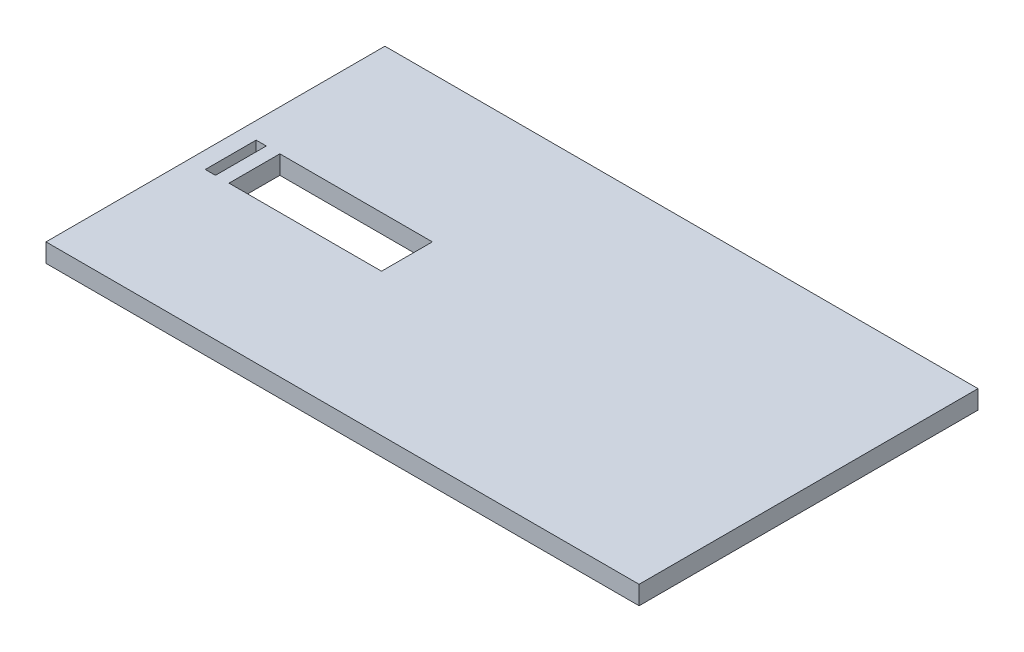
ISO-10303-21;
HEADER;
FILE_DESCRIPTION(('STEP AP214'),'2;1');
FILE_NAME('part.step','',(''),(''),'','','');
FILE_SCHEMA(('AUTOMOTIVE_DESIGN { 1 0 10303 214 1 1 1 1 }'));
ENDSEC;
DATA;
#1=APPLICATION_CONTEXT('core data for automotive mechanical design processes');
#2=APPLICATION_PROTOCOL_DEFINITION('international standard','automotive_design',2000,#1);
#3=PRODUCT_CONTEXT('',#1,'mechanical');
#4=PRODUCT('Part','Part','',(#3));
#5=PRODUCT_RELATED_PRODUCT_CATEGORY('part','',(#4));
#6=PRODUCT_DEFINITION_FORMATION('','',#4);
#7=PRODUCT_DEFINITION_CONTEXT('part definition',#1,'design');
#8=PRODUCT_DEFINITION('design','',#6,#7);
#9=PRODUCT_DEFINITION_SHAPE('','',#8);
#10=(LENGTH_UNIT() NAMED_UNIT(*) SI_UNIT(.MILLI.,.METRE.));
#11=(NAMED_UNIT(*) PLANE_ANGLE_UNIT() SI_UNIT($,.RADIAN.));
#12=(NAMED_UNIT(*) SI_UNIT($,.STERADIAN.) SOLID_ANGLE_UNIT());
#13=UNCERTAINTY_MEASURE_WITH_UNIT(LENGTH_MEASURE(1.E-05),#10,'distance_accuracy_value','');
#14=(GEOMETRIC_REPRESENTATION_CONTEXT(3) GLOBAL_UNCERTAINTY_ASSIGNED_CONTEXT((#13)) GLOBAL_UNIT_ASSIGNED_CONTEXT((#10,
#11,#12)) REPRESENTATION_CONTEXT('',''));
#15=CARTESIAN_POINT('',(0.,0.,0.));
#16=DIRECTION('',(0.,0.,1.));
#17=DIRECTION('',(1.,0.,0.));
#18=AXIS2_PLACEMENT_3D('',#15,#16,#17);
#19=CARTESIAN_POINT('',(-142.391304347826,11.,-94.0217391304348));
#20=DIRECTION('',(1.,0.,0.));
#21=DIRECTION('',(0.,0.,-1.));
#22=AXIS2_PLACEMENT_3D('',#19,#20,#21);
#23=PLANE('',#22);
#24=DIRECTION('',(0.,0.,1.));
#25=VECTOR('',#24,1.);
#26=CARTESIAN_POINT('',(-142.391304347826,0.,-94.0217391304348));
#27=LINE('',#26,#25);
#28=CARTESIAN_POINT('',(-142.391304347826,0.,-94.0217391304348));
#29=VERTEX_POINT('',#28);
#30=CARTESIAN_POINT('',(-142.391304347826,0.,105.978260869565));
#31=VERTEX_POINT('',#30);
#32=EDGE_CURVE('E190',#29,#31,#27,.T.);
#33=ORIENTED_EDGE('',*,*,#32,.T.);
#34=DIRECTION('',(0.,-1.,0.));
#35=VECTOR('',#34,1.);
#36=CARTESIAN_POINT('',(-142.391304347826,11.,105.978260869565));
#37=LINE('',#36,#35);
#38=CARTESIAN_POINT('',(-142.391304347826,11.,105.978260869565));
#39=VERTEX_POINT('',#38);
#40=EDGE_CURVE('E11',#39,#31,#37,.T.);
#41=ORIENTED_EDGE('',*,*,#40,.F.);
#42=DIRECTION('',(0.,0.,1.));
#43=VECTOR('',#42,1.);
#44=CARTESIAN_POINT('',(-142.391304347826,11.,-94.0217391304348));
#45=LINE('',#44,#43);
#46=CARTESIAN_POINT('',(-142.391304347826,11.,-94.0217391304348));
#47=VERTEX_POINT('',#46);
#48=EDGE_CURVE('E191',#47,#39,#45,.T.);
#49=ORIENTED_EDGE('',*,*,#48,.F.);
#50=DIRECTION('',(0.,-1.,0.));
#51=VECTOR('',#50,1.);
#52=CARTESIAN_POINT('',(-142.391304347826,11.,-94.0217391304348));
#53=LINE('',#52,#51);
#54=EDGE_CURVE('E201',#47,#29,#53,.T.);
#55=ORIENTED_EDGE('',*,*,#54,.T.);
#56=EDGE_LOOP('',(#33,#41,#49,#55));
#57=FACE_BOUND('',#56,.T.);
#58=ADVANCED_FACE('F33',(#57),#23,.F.);
#59=CARTESIAN_POINT('',(-142.391304347826,11.,105.978260869565));
#60=DIRECTION('',(0.,0.,-1.));
#61=DIRECTION('',(-1.,0.,0.));
#62=AXIS2_PLACEMENT_3D('',#59,#60,#61);
#63=PLANE('',#62);
#64=DIRECTION('',(1.,0.,0.));
#65=VECTOR('',#64,1.);
#66=CARTESIAN_POINT('',(-142.391304347826,0.,105.978260869565));
#67=LINE('',#66,#65);
#68=CARTESIAN_POINT('',(207.608695652174,0.,105.978260869565));
#69=VERTEX_POINT('',#68);
#70=EDGE_CURVE('E204',#31,#69,#67,.T.);
#71=ORIENTED_EDGE('',*,*,#70,.T.);
#72=DIRECTION('',(0.,-1.,0.));
#73=VECTOR('',#72,1.);
#74=CARTESIAN_POINT('',(207.608695652174,11.,105.978260869565));
#75=LINE('',#74,#73);
#76=CARTESIAN_POINT('',(207.608695652174,11.,105.978260869565));
#77=VERTEX_POINT('',#76);
#78=EDGE_CURVE('E40',#77,#69,#75,.T.);
#79=ORIENTED_EDGE('',*,*,#78,.F.);
#80=DIRECTION('',(1.,0.,0.));
#81=VECTOR('',#80,1.);
#82=CARTESIAN_POINT('',(-142.391304347826,11.,105.978260869565));
#83=LINE('',#82,#81);
#84=EDGE_CURVE('E194',#39,#77,#83,.T.);
#85=ORIENTED_EDGE('',*,*,#84,.F.);
#86=ORIENTED_EDGE('',*,*,#40,.T.);
#87=EDGE_LOOP('',(#71,#79,#85,#86));
#88=FACE_BOUND('',#87,.T.);
#89=ADVANCED_FACE('F233',(#88),#63,.F.);
#90=CARTESIAN_POINT('',(207.608695652174,11.,-94.0217391304348));
#91=DIRECTION('',(-1.,0.,0.));
#92=DIRECTION('',(0.,0.,1.));
#93=AXIS2_PLACEMENT_3D('',#90,#91,#92);
#94=PLANE('',#93);
#95=DIRECTION('',(0.,0.,-1.));
#96=VECTOR('',#95,1.);
#97=CARTESIAN_POINT('',(207.608695652174,0.,-94.0217391304348));
#98=LINE('',#97,#96);
#99=CARTESIAN_POINT('',(207.608695652174,0.,-94.0217391304348));
#100=VERTEX_POINT('',#99);
#101=EDGE_CURVE('E206',#69,#100,#98,.T.);
#102=ORIENTED_EDGE('',*,*,#101,.T.);
#103=DIRECTION('',(0.,-1.,0.));
#104=VECTOR('',#103,1.);
#105=CARTESIAN_POINT('',(207.608695652174,11.,-94.0217391304348));
#106=LINE('',#105,#104);
#107=CARTESIAN_POINT('',(207.608695652174,11.,-94.0217391304348));
#108=VERTEX_POINT('',#107);
#109=EDGE_CURVE('E211',#108,#100,#106,.T.);
#110=ORIENTED_EDGE('',*,*,#109,.F.);
#111=DIRECTION('',(0.,0.,-1.));
#112=VECTOR('',#111,1.);
#113=CARTESIAN_POINT('',(207.608695652174,11.,-94.0217391304348));
#114=LINE('',#113,#112);
#115=EDGE_CURVE('E197',#77,#108,#114,.T.);
#116=ORIENTED_EDGE('',*,*,#115,.F.);
#117=ORIENTED_EDGE('',*,*,#78,.T.);
#118=EDGE_LOOP('',(#102,#110,#116,#117));
#119=FACE_BOUND('',#118,.T.);
#120=ADVANCED_FACE('F218',(#119),#94,.F.);
#121=CARTESIAN_POINT('',(-142.391304347826,11.,-94.0217391304348));
#122=DIRECTION('',(0.,0.,1.));
#123=DIRECTION('',(1.,0.,0.));
#124=AXIS2_PLACEMENT_3D('',#121,#122,#123);
#125=PLANE('',#124);
#126=DIRECTION('',(-1.,0.,0.));
#127=VECTOR('',#126,1.);
#128=CARTESIAN_POINT('',(-142.391304347826,0.,-94.0217391304348));
#129=LINE('',#128,#127);
#130=EDGE_CURVE('E195',#100,#29,#129,.T.);
#131=ORIENTED_EDGE('',*,*,#130,.T.);
#132=ORIENTED_EDGE('',*,*,#54,.F.);
#133=DIRECTION('',(-1.,0.,0.));
#134=VECTOR('',#133,1.);
#135=CARTESIAN_POINT('',(-142.391304347826,11.,-94.0217391304348));
#136=LINE('',#135,#134);
#137=EDGE_CURVE('E199',#108,#47,#136,.T.);
#138=ORIENTED_EDGE('',*,*,#137,.F.);
#139=ORIENTED_EDGE('',*,*,#109,.T.);
#140=EDGE_LOOP('',(#131,#132,#138,#139));
#141=FACE_BOUND('',#140,.T.);
#142=ADVANCED_FACE('F226',(#141),#125,.F.);
#143=CARTESIAN_POINT('',(0.,11.,0.));
#144=DIRECTION('',(0.,1.,0.));
#145=DIRECTION('',(0.,0.,1.));
#146=AXIS2_PLACEMENT_3D('',#143,#144,#145);
#147=PLANE('',#146);
#148=DIRECTION('',(0.,0.,1.));
#149=VECTOR('',#148,1.);
#150=CARTESIAN_POINT('',(-118.391304347826,11.,0.));
#151=LINE('',#150,#149);
#152=CARTESIAN_POINT('',(-118.391304347826,11.,-8.02173913043478));
#153=VERTEX_POINT('',#152);
#154=CARTESIAN_POINT('',(-118.391304347826,11.,21.9782608695652));
#155=VERTEX_POINT('',#154);
#156=EDGE_CURVE('E126',#153,#155,#151,.T.);
#157=ORIENTED_EDGE('',*,*,#156,.F.);
#158=DIRECTION('',(-1.,0.,0.));
#159=VECTOR('',#158,1.);
#160=CARTESIAN_POINT('',(0.,11.,-8.02173913043478));
#161=LINE('',#160,#159);
#162=CARTESIAN_POINT('',(-28.3913043478259,11.,-8.02173913043478));
#163=VERTEX_POINT('',#162);
#164=EDGE_CURVE('E187',#163,#153,#161,.T.);
#165=ORIENTED_EDGE('',*,*,#164,.F.);
#166=DIRECTION('',(0.,0.,-1.));
#167=VECTOR('',#166,1.);
#168=CARTESIAN_POINT('',(-28.3913043478259,11.,0.));
#169=LINE('',#168,#167);
#170=CARTESIAN_POINT('',(-28.3913043478259,11.,21.9782608695652));
#171=VERTEX_POINT('',#170);
#172=EDGE_CURVE('E185',#171,#163,#169,.T.);
#173=ORIENTED_EDGE('',*,*,#172,.F.);
#174=DIRECTION('',(1.,0.,0.));
#175=VECTOR('',#174,1.);
#176=CARTESIAN_POINT('',(0.,11.,21.9782608695652));
#177=LINE('',#176,#175);
#178=EDGE_CURVE('E183',#155,#171,#177,.T.);
#179=ORIENTED_EDGE('',*,*,#178,.F.);
#180=EDGE_LOOP('',(#157,#165,#173,#179));
#181=FACE_BOUND('',#180,.T.);
#182=DIRECTION('',(0.,0.,1.));
#183=VECTOR('',#182,1.);
#184=CARTESIAN_POINT('',(-132.391304347826,11.,1.22486561955927E-13));
#185=LINE('',#184,#183);
#186=CARTESIAN_POINT('',(-132.391304347826,11.,-8.02173913043478));
#187=VERTEX_POINT('',#186);
#188=CARTESIAN_POINT('',(-132.391304347826,11.,21.9782608695652));
#189=VERTEX_POINT('',#188);
#190=EDGE_CURVE('E181',#187,#189,#185,.T.);
#191=ORIENTED_EDGE('',*,*,#190,.F.);
#192=DIRECTION('',(-1.,0.,0.));
#193=VECTOR('',#192,1.);
#194=CARTESIAN_POINT('',(0.,11.,-8.02173913043478));
#195=LINE('',#194,#193);
#196=CARTESIAN_POINT('',(-126.391304347826,11.,-8.02173913043478));
#197=VERTEX_POINT('',#196);
#198=EDGE_CURVE('E179',#197,#187,#195,.T.);
#199=ORIENTED_EDGE('',*,*,#198,.F.);
#200=DIRECTION('',(0.,0.,-1.));
#201=VECTOR('',#200,1.);
#202=CARTESIAN_POINT('',(-126.391304347826,11.,0.));
#203=LINE('',#202,#201);
#204=CARTESIAN_POINT('',(-126.391304347826,11.,21.9782608695652));
#205=VERTEX_POINT('',#204);
#206=EDGE_CURVE('E177',#205,#197,#203,.T.);
#207=ORIENTED_EDGE('',*,*,#206,.F.);
#208=DIRECTION('',(1.,0.,0.));
#209=VECTOR('',#208,1.);
#210=CARTESIAN_POINT('',(0.,11.,21.9782608695652));
#211=LINE('',#210,#209);
#212=EDGE_CURVE('E153',#189,#205,#211,.T.);
#213=ORIENTED_EDGE('',*,*,#212,.F.);
#214=EDGE_LOOP('',(#191,#199,#207,#213));
#215=FACE_BOUND('',#214,.T.);
#216=ORIENTED_EDGE('',*,*,#48,.T.);
#217=ORIENTED_EDGE('',*,*,#84,.T.);
#218=ORIENTED_EDGE('',*,*,#115,.T.);
#219=ORIENTED_EDGE('',*,*,#137,.T.);
#220=EDGE_LOOP('',(#216,#217,#218,#219));
#221=FACE_BOUND('',#220,.T.);
#222=ADVANCED_FACE('F232',(#181,#215,#221),#147,.T.);
#223=CARTESIAN_POINT('',(0.,0.,0.));
#224=DIRECTION('',(0.,1.,0.));
#225=DIRECTION('',(0.,0.,1.));
#226=AXIS2_PLACEMENT_3D('',#223,#224,#225);
#227=PLANE('',#226);
#228=DIRECTION('',(-1.,0.,0.));
#229=VECTOR('',#228,1.);
#230=CARTESIAN_POINT('',(-118.391304347826,0.,-8.02173913043478));
#231=LINE('',#230,#229);
#232=CARTESIAN_POINT('',(-28.3913043478259,0.,-8.02173913043478));
#233=VERTEX_POINT('',#232);
#234=CARTESIAN_POINT('',(-118.391304347826,0.,-8.02173913043478));
#235=VERTEX_POINT('',#234);
#236=EDGE_CURVE('E129',#233,#235,#231,.T.);
#237=ORIENTED_EDGE('',*,*,#236,.T.);
#238=DIRECTION('',(0.,0.,1.));
#239=VECTOR('',#238,1.);
#240=CARTESIAN_POINT('',(-118.391304347826,0.,-8.02173913043478));
#241=LINE('',#240,#239);
#242=CARTESIAN_POINT('',(-118.391304347826,0.,21.9782608695652));
#243=VERTEX_POINT('',#242);
#244=EDGE_CURVE('E123',#235,#243,#241,.T.);
#245=ORIENTED_EDGE('',*,*,#244,.T.);
#246=DIRECTION('',(1.,0.,0.));
#247=VECTOR('',#246,1.);
#248=CARTESIAN_POINT('',(-118.391304347826,0.,21.9782608695652));
#249=LINE('',#248,#247);
#250=CARTESIAN_POINT('',(-28.3913043478259,0.,21.9782608695652));
#251=VERTEX_POINT('',#250);
#252=EDGE_CURVE('E133',#243,#251,#249,.T.);
#253=ORIENTED_EDGE('',*,*,#252,.T.);
#254=DIRECTION('',(0.,0.,-1.));
#255=VECTOR('',#254,1.);
#256=CARTESIAN_POINT('',(-28.3913043478259,0.,-8.02173913043478));
#257=LINE('',#256,#255);
#258=EDGE_CURVE('E138',#251,#233,#257,.T.);
#259=ORIENTED_EDGE('',*,*,#258,.T.);
#260=EDGE_LOOP('',(#237,#245,#253,#259));
#261=FACE_BOUND('',#260,.T.);
#262=DIRECTION('',(-1.,0.,0.));
#263=VECTOR('',#262,1.);
#264=CARTESIAN_POINT('',(-132.391304347826,0.,-8.02173913043478));
#265=LINE('',#264,#263);
#266=CARTESIAN_POINT('',(-126.391304347826,0.,-8.02173913043478));
#267=VERTEX_POINT('',#266);
#268=CARTESIAN_POINT('',(-132.391304347826,0.,-8.02173913043478));
#269=VERTEX_POINT('',#268);
#270=EDGE_CURVE('E167',#267,#269,#265,.T.);
#271=ORIENTED_EDGE('',*,*,#270,.T.);
#272=DIRECTION('',(0.,0.,1.));
#273=VECTOR('',#272,1.);
#274=CARTESIAN_POINT('',(-132.391304347826,0.,-8.02173913043478));
#275=LINE('',#274,#273);
#276=CARTESIAN_POINT('',(-132.391304347826,0.,21.9782608695652));
#277=VERTEX_POINT('',#276);
#278=EDGE_CURVE('E158',#269,#277,#275,.T.);
#279=ORIENTED_EDGE('',*,*,#278,.T.);
#280=DIRECTION('',(1.,0.,0.));
#281=VECTOR('',#280,1.);
#282=CARTESIAN_POINT('',(-132.391304347826,0.,21.9782608695652));
#283=LINE('',#282,#281);
#284=CARTESIAN_POINT('',(-126.391304347826,0.,21.9782608695652));
#285=VERTEX_POINT('',#284);
#286=EDGE_CURVE('E161',#277,#285,#283,.T.);
#287=ORIENTED_EDGE('',*,*,#286,.T.);
#288=DIRECTION('',(0.,0.,-1.));
#289=VECTOR('',#288,1.);
#290=CARTESIAN_POINT('',(-126.391304347826,0.,-8.02173913043478));
#291=LINE('',#290,#289);
#292=EDGE_CURVE('E164',#285,#267,#291,.T.);
#293=ORIENTED_EDGE('',*,*,#292,.T.);
#294=EDGE_LOOP('',(#271,#279,#287,#293));
#295=FACE_BOUND('',#294,.T.);
#296=ORIENTED_EDGE('',*,*,#32,.F.);
#297=ORIENTED_EDGE('',*,*,#130,.F.);
#298=ORIENTED_EDGE('',*,*,#101,.F.);
#299=ORIENTED_EDGE('',*,*,#70,.F.);
#300=EDGE_LOOP('',(#296,#297,#298,#299));
#301=FACE_BOUND('',#300,.T.);
#302=ADVANCED_FACE('F140',(#261,#295,#301),#227,.F.);
#303=CARTESIAN_POINT('',(-132.391304347826,0.,-8.02173913043478));
#304=DIRECTION('',(-1.,0.,0.));
#305=DIRECTION('',(0.,0.,1.));
#306=AXIS2_PLACEMENT_3D('',#303,#304,#305);
#307=PLANE('',#306);
#308=ORIENTED_EDGE('',*,*,#190,.T.);
#309=DIRECTION('',(0.,1.,0.));
#310=VECTOR('',#309,1.);
#311=CARTESIAN_POINT('',(-132.391304347826,0.,21.9782608695652));
#312=LINE('',#311,#310);
#313=EDGE_CURVE('E55',#277,#189,#312,.T.);
#314=ORIENTED_EDGE('',*,*,#313,.F.);
#315=ORIENTED_EDGE('',*,*,#278,.F.);
#316=DIRECTION('',(0.,1.,0.));
#317=VECTOR('',#316,1.);
#318=CARTESIAN_POINT('',(-132.391304347826,0.,-8.02173913043478));
#319=LINE('',#318,#317);
#320=EDGE_CURVE('E143',#269,#187,#319,.T.);
#321=ORIENTED_EDGE('',*,*,#320,.T.);
#322=EDGE_LOOP('',(#308,#314,#315,#321));
#323=FACE_BOUND('',#322,.T.);
#324=ADVANCED_FACE('F245',(#323),#307,.F.);
#325=CARTESIAN_POINT('',(-132.391304347826,0.,-8.02173913043478));
#326=DIRECTION('',(0.,0.,-1.));
#327=DIRECTION('',(-1.,0.,0.));
#328=AXIS2_PLACEMENT_3D('',#325,#326,#327);
#329=PLANE('',#328);
#330=ORIENTED_EDGE('',*,*,#198,.T.);
#331=ORIENTED_EDGE('',*,*,#320,.F.);
#332=ORIENTED_EDGE('',*,*,#270,.F.);
#333=DIRECTION('',(0.,1.,0.));
#334=VECTOR('',#333,1.);
#335=CARTESIAN_POINT('',(-126.391304347826,0.,-8.02173913043478));
#336=LINE('',#335,#334);
#337=EDGE_CURVE('E146',#267,#197,#336,.T.);
#338=ORIENTED_EDGE('',*,*,#337,.T.);
#339=EDGE_LOOP('',(#330,#331,#332,#338));
#340=FACE_BOUND('',#339,.T.);
#341=ADVANCED_FACE('F251',(#340),#329,.F.);
#342=CARTESIAN_POINT('',(-126.391304347826,0.,-8.02173913043478));
#343=DIRECTION('',(1.,0.,0.));
#344=DIRECTION('',(0.,0.,-1.));
#345=AXIS2_PLACEMENT_3D('',#342,#343,#344);
#346=PLANE('',#345);
#347=ORIENTED_EDGE('',*,*,#206,.T.);
#348=ORIENTED_EDGE('',*,*,#337,.F.);
#349=ORIENTED_EDGE('',*,*,#292,.F.);
#350=DIRECTION('',(0.,1.,0.));
#351=VECTOR('',#350,1.);
#352=CARTESIAN_POINT('',(-126.391304347826,0.,21.9782608695652));
#353=LINE('',#352,#351);
#354=EDGE_CURVE('E172',#285,#205,#353,.T.);
#355=ORIENTED_EDGE('',*,*,#354,.T.);
#356=EDGE_LOOP('',(#347,#348,#349,#355));
#357=FACE_BOUND('',#356,.T.);
#358=ADVANCED_FACE('F256',(#357),#346,.F.);
#359=CARTESIAN_POINT('',(-132.391304347826,0.,21.9782608695652));
#360=DIRECTION('',(0.,0.,1.));
#361=DIRECTION('',(1.,0.,0.));
#362=AXIS2_PLACEMENT_3D('',#359,#360,#361);
#363=PLANE('',#362);
#364=ORIENTED_EDGE('',*,*,#212,.T.);
#365=ORIENTED_EDGE('',*,*,#354,.F.);
#366=ORIENTED_EDGE('',*,*,#286,.F.);
#367=ORIENTED_EDGE('',*,*,#313,.T.);
#368=EDGE_LOOP('',(#364,#365,#366,#367));
#369=FACE_BOUND('',#368,.T.);
#370=ADVANCED_FACE('F253',(#369),#363,.F.);
#371=CARTESIAN_POINT('',(-118.391304347826,0.,-8.02173913043478));
#372=DIRECTION('',(-1.,0.,0.));
#373=DIRECTION('',(0.,0.,1.));
#374=AXIS2_PLACEMENT_3D('',#371,#372,#373);
#375=PLANE('',#374);
#376=ORIENTED_EDGE('',*,*,#156,.T.);
#377=DIRECTION('',(0.,1.,0.));
#378=VECTOR('',#377,1.);
#379=CARTESIAN_POINT('',(-118.391304347826,0.,21.9782608695652));
#380=LINE('',#379,#378);
#381=EDGE_CURVE('E47',#243,#155,#380,.T.);
#382=ORIENTED_EDGE('',*,*,#381,.F.);
#383=ORIENTED_EDGE('',*,*,#244,.F.);
#384=DIRECTION('',(0.,1.,0.));
#385=VECTOR('',#384,1.);
#386=CARTESIAN_POINT('',(-118.391304347826,0.,-8.02173913043478));
#387=LINE('',#386,#385);
#388=EDGE_CURVE('E151',#235,#153,#387,.T.);
#389=ORIENTED_EDGE('',*,*,#388,.T.);
#390=EDGE_LOOP('',(#376,#382,#383,#389));
#391=FACE_BOUND('',#390,.T.);
#392=ADVANCED_FACE('F120',(#391),#375,.F.);
#393=CARTESIAN_POINT('',(-118.391304347826,0.,-8.02173913043478));
#394=DIRECTION('',(0.,0.,-1.));
#395=DIRECTION('',(-1.,0.,0.));
#396=AXIS2_PLACEMENT_3D('',#393,#394,#395);
#397=PLANE('',#396);
#398=ORIENTED_EDGE('',*,*,#164,.T.);
#399=ORIENTED_EDGE('',*,*,#388,.F.);
#400=ORIENTED_EDGE('',*,*,#236,.F.);
#401=DIRECTION('',(0.,1.,0.));
#402=VECTOR('',#401,1.);
#403=CARTESIAN_POINT('',(-28.3913043478259,0.,-8.02173913043478));
#404=LINE('',#403,#402);
#405=EDGE_CURVE('E154',#233,#163,#404,.T.);
#406=ORIENTED_EDGE('',*,*,#405,.T.);
#407=EDGE_LOOP('',(#398,#399,#400,#406));
#408=FACE_BOUND('',#407,.T.);
#409=ADVANCED_FACE('F265',(#408),#397,.F.);
#410=CARTESIAN_POINT('',(-28.3913043478259,0.,-8.02173913043478));
#411=DIRECTION('',(1.,0.,0.));
#412=DIRECTION('',(0.,0.,-1.));
#413=AXIS2_PLACEMENT_3D('',#410,#411,#412);
#414=PLANE('',#413);
#415=ORIENTED_EDGE('',*,*,#172,.T.);
#416=ORIENTED_EDGE('',*,*,#405,.F.);
#417=ORIENTED_EDGE('',*,*,#258,.F.);
#418=DIRECTION('',(0.,1.,0.));
#419=VECTOR('',#418,1.);
#420=CARTESIAN_POINT('',(-28.3913043478259,0.,21.9782608695652));
#421=LINE('',#420,#419);
#422=EDGE_CURVE('E128',#251,#171,#421,.T.);
#423=ORIENTED_EDGE('',*,*,#422,.T.);
#424=EDGE_LOOP('',(#415,#416,#417,#423));
#425=FACE_BOUND('',#424,.T.);
#426=ADVANCED_FACE('F268',(#425),#414,.F.);
#427=CARTESIAN_POINT('',(-118.391304347826,0.,21.9782608695652));
#428=DIRECTION('',(0.,0.,1.));
#429=DIRECTION('',(1.,0.,0.));
#430=AXIS2_PLACEMENT_3D('',#427,#428,#429);
#431=PLANE('',#430);
#432=ORIENTED_EDGE('',*,*,#178,.T.);
#433=ORIENTED_EDGE('',*,*,#422,.F.);
#434=ORIENTED_EDGE('',*,*,#252,.F.);
#435=ORIENTED_EDGE('',*,*,#381,.T.);
#436=EDGE_LOOP('',(#432,#433,#434,#435));
#437=FACE_BOUND('',#436,.T.);
#438=ADVANCED_FACE('F134',(#437),#431,.F.);
#439=CLOSED_SHELL('',(#58,#89,#120,#142,#222,#302,#324,#341,#358,#370,#392,#409,#426,#438));
#440=MANIFOLD_SOLID_BREP('B2',#439);
#441=ADVANCED_BREP_SHAPE_REPRESENTATION('',(#18,#440),#14);
#442=SHAPE_DEFINITION_REPRESENTATION(#9,#441);
ENDSEC;
END-ISO-10303-21;
